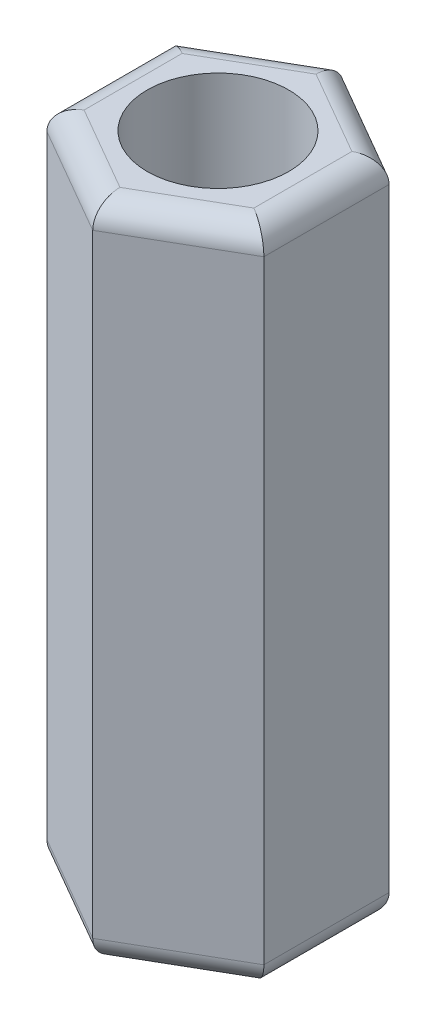
ISO-10303-21;
HEADER;
FILE_DESCRIPTION(('STEP AP214'),'2;1');
FILE_NAME('part.step','',(''),(''),'','','');
FILE_SCHEMA(('AUTOMOTIVE_DESIGN { 1 0 10303 214 1 1 1 1 }'));
ENDSEC;
DATA;
#1=APPLICATION_CONTEXT('core data for automotive mechanical design processes');
#2=APPLICATION_PROTOCOL_DEFINITION('international standard','automotive_design',2000,#1);
#3=PRODUCT_CONTEXT('',#1,'mechanical');
#4=PRODUCT('Part','Part','',(#3));
#5=PRODUCT_RELATED_PRODUCT_CATEGORY('part','',(#4));
#6=PRODUCT_DEFINITION_FORMATION('','',#4);
#7=PRODUCT_DEFINITION_CONTEXT('part definition',#1,'design');
#8=PRODUCT_DEFINITION('design','',#6,#7);
#9=PRODUCT_DEFINITION_SHAPE('','',#8);
#10=(LENGTH_UNIT() NAMED_UNIT(*) SI_UNIT(.MILLI.,.METRE.));
#11=(NAMED_UNIT(*) PLANE_ANGLE_UNIT() SI_UNIT($,.RADIAN.));
#12=(NAMED_UNIT(*) SI_UNIT($,.STERADIAN.) SOLID_ANGLE_UNIT());
#13=UNCERTAINTY_MEASURE_WITH_UNIT(LENGTH_MEASURE(1.E-05),#10,'distance_accuracy_value','');
#14=(GEOMETRIC_REPRESENTATION_CONTEXT(3) GLOBAL_UNCERTAINTY_ASSIGNED_CONTEXT((#13)) GLOBAL_UNIT_ASSIGNED_CONTEXT((#10,
#11,#12)) REPRESENTATION_CONTEXT('',''));
#15=CARTESIAN_POINT('',(0.,0.,0.));
#16=DIRECTION('',(0.,0.,1.));
#17=DIRECTION('',(1.,0.,0.));
#18=AXIS2_PLACEMENT_3D('',#15,#16,#17);
#19=CARTESIAN_POINT('',(0.,14.,0.));
#20=DIRECTION('',(0.,1.,0.));
#21=DIRECTION('',(0.,0.,1.));
#22=AXIS2_PLACEMENT_3D('',#19,#20,#21);
#23=PLANE('',#22);
#24=DIRECTION('',(0.,0.,1.));
#25=VECTOR('',#24,1.);
#26=CARTESIAN_POINT('',(-1.8,14.,1.32790561913614));
#27=LINE('',#26,#25);
#28=CARTESIAN_POINT('',(-1.8,14.,-1.03923048454133));
#29=VERTEX_POINT('',#28);
#30=CARTESIAN_POINT('',(-1.8,14.,1.03923048454133));
#31=VERTEX_POINT('',#30);
#32=EDGE_CURVE('E44',#29,#31,#27,.T.);
#33=ORIENTED_EDGE('',*,*,#32,.T.);
#34=DIRECTION('',(0.866025403784439,0.,0.5));
#35=VECTOR('',#34,1.);
#36=CARTESIAN_POINT('',(0.25,14.,2.22279853638006));
#37=LINE('',#36,#35);
#38=CARTESIAN_POINT('',(0.,14.,2.07846096908265));
#39=VERTEX_POINT('',#38);
#40=EDGE_CURVE('E11',#31,#39,#37,.T.);
#41=ORIENTED_EDGE('',*,*,#40,.T.);
#42=DIRECTION('',(0.866025403784439,0.,-0.5));
#43=VECTOR('',#42,1.);
#44=CARTESIAN_POINT('',(2.05,14.,0.894892917243921));
#45=LINE('',#44,#43);
#46=CARTESIAN_POINT('',(1.8,14.,1.03923048454133));
#47=VERTEX_POINT('',#46);
#48=EDGE_CURVE('E160',#39,#47,#45,.T.);
#49=ORIENTED_EDGE('',*,*,#48,.T.);
#50=DIRECTION('',(0.,0.,-1.));
#51=VECTOR('',#50,1.);
#52=CARTESIAN_POINT('',(1.8,14.,-1.32790561913614));
#53=LINE('',#52,#51);
#54=CARTESIAN_POINT('',(1.8,14.,-1.03923048454133));
#55=VERTEX_POINT('',#54);
#56=EDGE_CURVE('E257',#47,#55,#53,.T.);
#57=ORIENTED_EDGE('',*,*,#56,.T.);
#58=DIRECTION('',(-0.866025403784439,0.,-0.5));
#59=VECTOR('',#58,1.);
#60=CARTESIAN_POINT('',(-0.25,14.,-2.22279853638006));
#61=LINE('',#60,#59);
#62=CARTESIAN_POINT('',(0.,14.,-2.07846096908265));
#63=VERTEX_POINT('',#62);
#64=EDGE_CURVE('E259',#55,#63,#61,.T.);
#65=ORIENTED_EDGE('',*,*,#64,.T.);
#66=DIRECTION('',(-0.866025403784439,0.,0.5));
#67=VECTOR('',#66,1.);
#68=CARTESIAN_POINT('',(-2.05,14.,-0.894892917243921));
#69=LINE('',#68,#67);
#70=EDGE_CURVE('E55',#63,#29,#69,.T.);
#71=ORIENTED_EDGE('',*,*,#70,.T.);
#72=EDGE_LOOP('',(#33,#41,#49,#57,#65,#71));
#73=FACE_BOUND('',#72,.T.);
#74=CARTESIAN_POINT('',(0.,14.,0.));
#75=DIRECTION('',(0.,1.,0.));
#76=DIRECTION('',(0.,0.,1.));
#77=AXIS2_PLACEMENT_3D('',#74,#75,#76);
#78=CIRCLE('',#77,1.5);
#79=CARTESIAN_POINT('',(0.,14.,1.5));
#80=VERTEX_POINT('',#79);
#81=EDGE_CURVE('E149',#80,#80,#78,.T.);
#82=ORIENTED_EDGE('',*,*,#81,.F.);
#83=EDGE_LOOP('',(#82));
#84=FACE_BOUND('',#83,.T.);
#85=ADVANCED_FACE('F35',(#73,#84),#23,.T.);
#86=CARTESIAN_POINT('',(0.,0.,0.));
#87=DIRECTION('',(0.,1.,0.));
#88=DIRECTION('',(0.,0.,1.));
#89=AXIS2_PLACEMENT_3D('',#86,#87,#88);
#90=PLANE('',#89);
#91=DIRECTION('',(0.866025403784439,0.,-0.5));
#92=VECTOR('',#91,1.);
#93=CARTESIAN_POINT('',(0.9,0.,1.55884572681199));
#94=LINE('',#93,#92);
#95=CARTESIAN_POINT('',(1.8,0.,1.03923048454133));
#96=VERTEX_POINT('',#95);
#97=CARTESIAN_POINT('',(0.,0.,2.07846096908265));
#98=VERTEX_POINT('',#97);
#99=EDGE_CURVE('E235',#96,#98,#94,.F.);
#100=ORIENTED_EDGE('',*,*,#99,.T.);
#101=DIRECTION('',(0.866025403784439,0.,0.5));
#102=VECTOR('',#101,1.);
#103=CARTESIAN_POINT('',(-0.9,0.,1.55884572681199));
#104=LINE('',#103,#102);
#105=CARTESIAN_POINT('',(-1.8,0.,1.03923048454133));
#106=VERTEX_POINT('',#105);
#107=EDGE_CURVE('E136',#98,#106,#104,.F.);
#108=ORIENTED_EDGE('',*,*,#107,.T.);
#109=DIRECTION('',(0.,0.,1.));
#110=VECTOR('',#109,1.);
#111=CARTESIAN_POINT('',(-1.8,0.,0.));
#112=LINE('',#111,#110);
#113=CARTESIAN_POINT('',(-1.8,0.,-1.03923048454133));
#114=VERTEX_POINT('',#113);
#115=EDGE_CURVE('E227',#106,#114,#112,.F.);
#116=ORIENTED_EDGE('',*,*,#115,.T.);
#117=DIRECTION('',(-0.866025403784439,0.,0.5));
#118=VECTOR('',#117,1.);
#119=CARTESIAN_POINT('',(-0.9,0.,-1.55884572681199));
#120=LINE('',#119,#118);
#121=CARTESIAN_POINT('',(0.,0.,-2.07846096908265));
#122=VERTEX_POINT('',#121);
#123=EDGE_CURVE('E229',#114,#122,#120,.F.);
#124=ORIENTED_EDGE('',*,*,#123,.T.);
#125=DIRECTION('',(-0.866025403784439,0.,-0.5));
#126=VECTOR('',#125,1.);
#127=CARTESIAN_POINT('',(0.9,0.,-1.55884572681199));
#128=LINE('',#127,#126);
#129=CARTESIAN_POINT('',(1.8,0.,-1.03923048454133));
#130=VERTEX_POINT('',#129);
#131=EDGE_CURVE('E231',#122,#130,#128,.F.);
#132=ORIENTED_EDGE('',*,*,#131,.T.);
#133=DIRECTION('',(0.,0.,-1.));
#134=VECTOR('',#133,1.);
#135=CARTESIAN_POINT('',(1.8,0.,0.));
#136=LINE('',#135,#134);
#137=EDGE_CURVE('E233',#130,#96,#136,.F.);
#138=ORIENTED_EDGE('',*,*,#137,.T.);
#139=EDGE_LOOP('',(#100,#108,#116,#124,#132,#138));
#140=FACE_BOUND('',#139,.T.);
#141=CARTESIAN_POINT('',(0.,0.,0.));
#142=DIRECTION('',(0.,1.,0.));
#143=DIRECTION('',(0.,0.,1.));
#144=AXIS2_PLACEMENT_3D('',#141,#142,#143);
#145=CIRCLE('',#144,1.5);
#146=CARTESIAN_POINT('',(0.,0.,1.5));
#147=VERTEX_POINT('',#146);
#148=EDGE_CURVE('E203',#147,#147,#145,.T.);
#149=ORIENTED_EDGE('',*,*,#148,.T.);
#150=EDGE_LOOP('',(#149));
#151=FACE_BOUND('',#150,.T.);
#152=ADVANCED_FACE('F303',(#140,#151),#90,.F.);
#153=CARTESIAN_POINT('',(0.,14.,2.65581123827228));
#154=DIRECTION('',(-0.5,0.,-0.866025403784439));
#155=DIRECTION('',(-0.866025403784439,0.,0.5));
#156=AXIS2_PLACEMENT_3D('',#153,#154,#155);
#157=PLANE('',#156);
#158=DIRECTION('',(0.,-1.,0.));
#159=VECTOR('',#158,1.);
#160=CARTESIAN_POINT('',(0.,14.,2.65581123827228));
#161=LINE('',#160,#159);
#162=CARTESIAN_POINT('',(0.,13.5,2.65581123827228));
#163=VERTEX_POINT('',#162);
#164=CARTESIAN_POINT('',(0.,0.5,2.65581123827228));
#165=VERTEX_POINT('',#164);
#166=EDGE_CURVE('E128',#163,#165,#161,.T.);
#167=ORIENTED_EDGE('',*,*,#166,.T.);
#168=DIRECTION('',(0.866025403784439,0.,-0.5));
#169=VECTOR('',#168,1.);
#170=CARTESIAN_POINT('',(0.,0.5,2.65581123827228));
#171=LINE('',#170,#169);
#172=CARTESIAN_POINT('',(2.3,0.5,1.32790561913614));
#173=VERTEX_POINT('',#172);
#174=EDGE_CURVE('E135',#165,#173,#171,.T.);
#175=ORIENTED_EDGE('',*,*,#174,.T.);
#176=DIRECTION('',(0.,-1.,0.));
#177=VECTOR('',#176,1.);
#178=CARTESIAN_POINT('',(2.3,14.,1.32790561913614));
#179=LINE('',#178,#177);
#180=CARTESIAN_POINT('',(2.3,13.5,1.32790561913614));
#181=VERTEX_POINT('',#180);
#182=EDGE_CURVE('E130',#181,#173,#179,.T.);
#183=ORIENTED_EDGE('',*,*,#182,.F.);
#184=DIRECTION('',(0.866025403784439,0.,-0.5));
#185=VECTOR('',#184,1.);
#186=CARTESIAN_POINT('',(0.,13.5,2.65581123827228));
#187=LINE('',#186,#185);
#188=EDGE_CURVE('E125',#181,#163,#187,.F.);
#189=ORIENTED_EDGE('',*,*,#188,.T.);
#190=EDGE_LOOP('',(#167,#175,#183,#189));
#191=FACE_BOUND('',#190,.T.);
#192=ADVANCED_FACE('F127',(#191),#157,.F.);
#193=CARTESIAN_POINT('',(2.3,14.,1.32790561913614));
#194=DIRECTION('',(-1.,0.,0.));
#195=DIRECTION('',(0.,0.,1.));
#196=AXIS2_PLACEMENT_3D('',#193,#194,#195);
#197=PLANE('',#196);
#198=ORIENTED_EDGE('',*,*,#182,.T.);
#199=DIRECTION('',(0.,0.,-1.));
#200=VECTOR('',#199,1.);
#201=CARTESIAN_POINT('',(2.3,0.5,1.32790561913614));
#202=LINE('',#201,#200);
#203=CARTESIAN_POINT('',(2.3,0.5,-1.32790561913614));
#204=VERTEX_POINT('',#203);
#205=EDGE_CURVE('E242',#173,#204,#202,.T.);
#206=ORIENTED_EDGE('',*,*,#205,.T.);
#207=DIRECTION('',(0.,-1.,0.));
#208=VECTOR('',#207,1.);
#209=CARTESIAN_POINT('',(2.3,14.,-1.32790561913614));
#210=LINE('',#209,#208);
#211=CARTESIAN_POINT('',(2.3,13.5,-1.32790561913614));
#212=VERTEX_POINT('',#211);
#213=EDGE_CURVE('E222',#212,#204,#210,.T.);
#214=ORIENTED_EDGE('',*,*,#213,.F.);
#215=DIRECTION('',(0.,0.,-1.));
#216=VECTOR('',#215,1.);
#217=CARTESIAN_POINT('',(2.3,13.5,1.32790561913614));
#218=LINE('',#217,#216);
#219=EDGE_CURVE('E240',#212,#181,#218,.F.);
#220=ORIENTED_EDGE('',*,*,#219,.T.);
#221=EDGE_LOOP('',(#198,#206,#214,#220));
#222=FACE_BOUND('',#221,.T.);
#223=ADVANCED_FACE('F271',(#222),#197,.F.);
#224=CARTESIAN_POINT('',(2.3,14.,-1.32790561913614));
#225=DIRECTION('',(-0.5,0.,0.866025403784439));
#226=DIRECTION('',(0.866025403784439,0.,0.5));
#227=AXIS2_PLACEMENT_3D('',#224,#225,#226);
#228=PLANE('',#227);
#229=ORIENTED_EDGE('',*,*,#213,.T.);
#230=DIRECTION('',(-0.866025403784439,0.,-0.5));
#231=VECTOR('',#230,1.);
#232=CARTESIAN_POINT('',(2.3,0.5,-1.32790561913614));
#233=LINE('',#232,#231);
#234=CARTESIAN_POINT('',(0.,0.5,-2.65581123827228));
#235=VERTEX_POINT('',#234);
#236=EDGE_CURVE('E246',#204,#235,#233,.T.);
#237=ORIENTED_EDGE('',*,*,#236,.T.);
#238=DIRECTION('',(0.,-1.,0.));
#239=VECTOR('',#238,1.);
#240=CARTESIAN_POINT('',(0.,14.,-2.65581123827228));
#241=LINE('',#240,#239);
#242=CARTESIAN_POINT('',(0.,13.5,-2.65581123827228));
#243=VERTEX_POINT('',#242);
#244=EDGE_CURVE('E219',#243,#235,#241,.T.);
#245=ORIENTED_EDGE('',*,*,#244,.F.);
#246=DIRECTION('',(-0.866025403784439,0.,-0.5));
#247=VECTOR('',#246,1.);
#248=CARTESIAN_POINT('',(2.3,13.5,-1.32790561913614));
#249=LINE('',#248,#247);
#250=EDGE_CURVE('E244',#243,#212,#249,.F.);
#251=ORIENTED_EDGE('',*,*,#250,.T.);
#252=EDGE_LOOP('',(#229,#237,#245,#251));
#253=FACE_BOUND('',#252,.T.);
#254=ADVANCED_FACE('F274',(#253),#228,.F.);
#255=CARTESIAN_POINT('',(0.,14.,-2.65581123827228));
#256=DIRECTION('',(0.5,0.,0.866025403784439));
#257=DIRECTION('',(0.866025403784439,0.,-0.5));
#258=AXIS2_PLACEMENT_3D('',#255,#256,#257);
#259=PLANE('',#258);
#260=ORIENTED_EDGE('',*,*,#244,.T.);
#261=DIRECTION('',(-0.866025403784439,0.,0.5));
#262=VECTOR('',#261,1.);
#263=CARTESIAN_POINT('',(0.,0.5,-2.65581123827228));
#264=LINE('',#263,#262);
#265=CARTESIAN_POINT('',(-2.3,0.5,-1.32790561913614));
#266=VERTEX_POINT('',#265);
#267=EDGE_CURVE('E250',#235,#266,#264,.T.);
#268=ORIENTED_EDGE('',*,*,#267,.T.);
#269=DIRECTION('',(0.,-1.,0.));
#270=VECTOR('',#269,1.);
#271=CARTESIAN_POINT('',(-2.3,14.,-1.32790561913614));
#272=LINE('',#271,#270);
#273=CARTESIAN_POINT('',(-2.3,13.5,-1.32790561913614));
#274=VERTEX_POINT('',#273);
#275=EDGE_CURVE('E216',#274,#266,#272,.T.);
#276=ORIENTED_EDGE('',*,*,#275,.F.);
#277=DIRECTION('',(-0.866025403784439,0.,0.5));
#278=VECTOR('',#277,1.);
#279=CARTESIAN_POINT('',(0.,13.5,-2.65581123827228));
#280=LINE('',#279,#278);
#281=EDGE_CURVE('E248',#274,#243,#280,.F.);
#282=ORIENTED_EDGE('',*,*,#281,.T.);
#283=EDGE_LOOP('',(#260,#268,#276,#282));
#284=FACE_BOUND('',#283,.T.);
#285=ADVANCED_FACE('F284',(#284),#259,.F.);
#286=CARTESIAN_POINT('',(-2.3,14.,-1.32790561913614));
#287=DIRECTION('',(1.,0.,0.));
#288=DIRECTION('',(0.,0.,-1.));
#289=AXIS2_PLACEMENT_3D('',#286,#287,#288);
#290=PLANE('',#289);
#291=ORIENTED_EDGE('',*,*,#275,.T.);
#292=DIRECTION('',(0.,0.,1.));
#293=VECTOR('',#292,1.);
#294=CARTESIAN_POINT('',(-2.3,0.5,-1.32790561913614));
#295=LINE('',#294,#293);
#296=CARTESIAN_POINT('',(-2.3,0.5,1.32790561913614));
#297=VERTEX_POINT('',#296);
#298=EDGE_CURVE('E254',#266,#297,#295,.T.);
#299=ORIENTED_EDGE('',*,*,#298,.T.);
#300=DIRECTION('',(0.,-1.,0.));
#301=VECTOR('',#300,1.);
#302=CARTESIAN_POINT('',(-2.3,14.,1.32790561913614));
#303=LINE('',#302,#301);
#304=CARTESIAN_POINT('',(-2.3,13.5,1.32790561913614));
#305=VERTEX_POINT('',#304);
#306=EDGE_CURVE('E148',#305,#297,#303,.T.);
#307=ORIENTED_EDGE('',*,*,#306,.F.);
#308=DIRECTION('',(0.,0.,1.));
#309=VECTOR('',#308,1.);
#310=CARTESIAN_POINT('',(-2.3,13.5,-1.32790561913614));
#311=LINE('',#310,#309);
#312=EDGE_CURVE('E252',#305,#274,#311,.F.);
#313=ORIENTED_EDGE('',*,*,#312,.T.);
#314=EDGE_LOOP('',(#291,#299,#307,#313));
#315=FACE_BOUND('',#314,.T.);
#316=ADVANCED_FACE('F286',(#315),#290,.F.);
#317=CARTESIAN_POINT('',(-2.3,14.,1.32790561913614));
#318=DIRECTION('',(0.5,0.,-0.866025403784438));
#319=DIRECTION('',(-0.866025403784439,0.,-0.5));
#320=AXIS2_PLACEMENT_3D('',#317,#318,#319);
#321=PLANE('',#320);
#322=ORIENTED_EDGE('',*,*,#306,.T.);
#323=DIRECTION('',(0.866025403784439,0.,0.5));
#324=VECTOR('',#323,1.);
#325=CARTESIAN_POINT('',(-2.3,0.5,1.32790561913614));
#326=LINE('',#325,#324);
#327=EDGE_CURVE('E147',#297,#165,#326,.T.);
#328=ORIENTED_EDGE('',*,*,#327,.T.);
#329=ORIENTED_EDGE('',*,*,#166,.F.);
#330=DIRECTION('',(0.866025403784439,0.,0.5));
#331=VECTOR('',#330,1.);
#332=CARTESIAN_POINT('',(-2.3,13.5,1.32790561913614));
#333=LINE('',#332,#331);
#334=EDGE_CURVE('E144',#163,#305,#333,.F.);
#335=ORIENTED_EDGE('',*,*,#334,.T.);
#336=EDGE_LOOP('',(#322,#328,#329,#335));
#337=FACE_BOUND('',#336,.T.);
#338=ADVANCED_FACE('F143',(#337),#321,.F.);
#339=CARTESIAN_POINT('',(0.,14.,0.));
#340=DIRECTION('',(0.,-1.,0.));
#341=DIRECTION('',(0.,0.,-1.));
#342=AXIS2_PLACEMENT_3D('',#339,#340,#341);
#343=CYLINDRICAL_SURFACE('',#342,1.5);
#344=ORIENTED_EDGE('',*,*,#81,.T.);
#345=EDGE_LOOP('',(#344));
#346=FACE_BOUND('',#345,.T.);
#347=ORIENTED_EDGE('',*,*,#148,.F.);
#348=EDGE_LOOP('',(#347));
#349=FACE_BOUND('',#348,.T.);
#350=ADVANCED_FACE('F311',(#346,#349),#343,.F.);
#351=CARTESIAN_POINT('',(2.05,0.5,-0.894892917243921));
#352=DIRECTION('',(-0.866025403784439,0.,-0.5));
#353=DIRECTION('',(-0.5,0.,0.866025403784439));
#354=AXIS2_PLACEMENT_3D('',#351,#352,#353);
#355=CYLINDRICAL_SURFACE('',#354,0.5);
#356=CARTESIAN_POINT('',(1.8,0.5,-1.03923048454133));
#357=DIRECTION('',(-0.5,0.,-0.866025403784439));
#358=DIRECTION('',(-0.866025403784439,0.,0.5));
#359=AXIS2_PLACEMENT_3D('',#356,#357,#358);
#360=ELLIPSE('',#359,0.577350269189626,0.5);
#361=EDGE_CURVE('E196',#130,#204,#360,.F.);
#362=ORIENTED_EDGE('',*,*,#361,.F.);
#363=ORIENTED_EDGE('',*,*,#131,.F.);
#364=CARTESIAN_POINT('',(0.,0.5,-2.07846096908265));
#365=DIRECTION('',(-1.,0.,0.));
#366=DIRECTION('',(0.,0.,1.));
#367=AXIS2_PLACEMENT_3D('',#364,#365,#366);
#368=ELLIPSE('',#367,0.577350269189626,0.5);
#369=EDGE_CURVE('E165',#235,#122,#368,.T.);
#370=ORIENTED_EDGE('',*,*,#369,.F.);
#371=ORIENTED_EDGE('',*,*,#236,.F.);
#372=EDGE_LOOP('',(#362,#363,#370,#371));
#373=FACE_BOUND('',#372,.T.);
#374=ADVANCED_FACE('F277',(#373),#355,.T.);
#375=CARTESIAN_POINT('',(0.25,0.5,-2.22279853638006));
#376=DIRECTION('',(-0.866025403784439,0.,0.5));
#377=DIRECTION('',(0.5,0.,0.866025403784439));
#378=AXIS2_PLACEMENT_3D('',#375,#376,#377);
#379=CYLINDRICAL_SURFACE('',#378,0.5);
#380=ORIENTED_EDGE('',*,*,#369,.T.);
#381=ORIENTED_EDGE('',*,*,#123,.F.);
#382=CARTESIAN_POINT('',(-1.8,0.5,-1.03923048454133));
#383=DIRECTION('',(-0.5,0.,0.866025403784439));
#384=DIRECTION('',(0.866025403784439,0.,0.5));
#385=AXIS2_PLACEMENT_3D('',#382,#383,#384);
#386=ELLIPSE('',#385,0.577350269189626,0.5);
#387=EDGE_CURVE('E194',#266,#114,#386,.T.);
#388=ORIENTED_EDGE('',*,*,#387,.F.);
#389=ORIENTED_EDGE('',*,*,#267,.F.);
#390=EDGE_LOOP('',(#380,#381,#388,#389));
#391=FACE_BOUND('',#390,.T.);
#392=ADVANCED_FACE('F280',(#391),#379,.T.);
#393=CARTESIAN_POINT('',(1.8,0.5,1.32790561913614));
#394=DIRECTION('',(0.,0.,-1.));
#395=DIRECTION('',(-1.,0.,0.));
#396=AXIS2_PLACEMENT_3D('',#393,#394,#395);
#397=CYLINDRICAL_SURFACE('',#396,0.5);
#398=ORIENTED_EDGE('',*,*,#361,.T.);
#399=ORIENTED_EDGE('',*,*,#205,.F.);
#400=CARTESIAN_POINT('',(1.8,0.5,1.03923048454133));
#401=DIRECTION('',(0.5,0.,-0.866025403784439));
#402=DIRECTION('',(-0.866025403784439,0.,-0.5));
#403=AXIS2_PLACEMENT_3D('',#400,#401,#402);
#404=ELLIPSE('',#403,0.577350269189626,0.5);
#405=EDGE_CURVE('E188',#96,#173,#404,.F.);
#406=ORIENTED_EDGE('',*,*,#405,.F.);
#407=ORIENTED_EDGE('',*,*,#137,.F.);
#408=EDGE_LOOP('',(#398,#399,#406,#407));
#409=FACE_BOUND('',#408,.T.);
#410=ADVANCED_FACE('F365',(#409),#397,.T.);
#411=CARTESIAN_POINT('',(-1.8,0.5,-1.32790561913614));
#412=DIRECTION('',(0.,0.,1.));
#413=DIRECTION('',(1.,0.,0.));
#414=AXIS2_PLACEMENT_3D('',#411,#412,#413);
#415=CYLINDRICAL_SURFACE('',#414,0.5);
#416=ORIENTED_EDGE('',*,*,#387,.T.);
#417=ORIENTED_EDGE('',*,*,#115,.F.);
#418=CARTESIAN_POINT('',(-1.8,0.5,1.03923048454133));
#419=DIRECTION('',(0.5,0.,0.866025403784439));
#420=DIRECTION('',(-0.866025403784439,0.,0.5));
#421=AXIS2_PLACEMENT_3D('',#418,#419,#420);
#422=ELLIPSE('',#421,0.577350269189626,0.5);
#423=EDGE_CURVE('E182',#297,#106,#422,.T.);
#424=ORIENTED_EDGE('',*,*,#423,.F.);
#425=ORIENTED_EDGE('',*,*,#298,.F.);
#426=EDGE_LOOP('',(#416,#417,#424,#425));
#427=FACE_BOUND('',#426,.T.);
#428=ADVANCED_FACE('F290',(#427),#415,.T.);
#429=CARTESIAN_POINT('',(-0.250000000000001,0.5,2.22279853638006));
#430=DIRECTION('',(0.866025403784439,0.,-0.5));
#431=DIRECTION('',(-0.5,0.,-0.866025403784439));
#432=AXIS2_PLACEMENT_3D('',#429,#430,#431);
#433=CYLINDRICAL_SURFACE('',#432,0.5);
#434=ORIENTED_EDGE('',*,*,#405,.T.);
#435=ORIENTED_EDGE('',*,*,#174,.F.);
#436=CARTESIAN_POINT('',(0.,0.5,2.07846096908265));
#437=DIRECTION('',(1.,0.,0.));
#438=DIRECTION('',(0.,0.,-1.));
#439=AXIS2_PLACEMENT_3D('',#436,#437,#438);
#440=ELLIPSE('',#439,0.577350269189626,0.5);
#441=EDGE_CURVE('E178',#98,#165,#440,.F.);
#442=ORIENTED_EDGE('',*,*,#441,.F.);
#443=ORIENTED_EDGE('',*,*,#99,.F.);
#444=EDGE_LOOP('',(#434,#435,#442,#443));
#445=FACE_BOUND('',#444,.T.);
#446=ADVANCED_FACE('F293',(#445),#433,.T.);
#447=CARTESIAN_POINT('',(-2.05,0.5,0.89489291724392));
#448=DIRECTION('',(0.866025403784439,0.,0.5));
#449=DIRECTION('',(0.5,0.,-0.866025403784438));
#450=AXIS2_PLACEMENT_3D('',#447,#448,#449);
#451=CYLINDRICAL_SURFACE('',#450,0.5);
#452=ORIENTED_EDGE('',*,*,#423,.T.);
#453=ORIENTED_EDGE('',*,*,#107,.F.);
#454=ORIENTED_EDGE('',*,*,#441,.T.);
#455=ORIENTED_EDGE('',*,*,#327,.F.);
#456=EDGE_LOOP('',(#452,#453,#454,#455));
#457=FACE_BOUND('',#456,.T.);
#458=ADVANCED_FACE('F291',(#457),#451,.T.);
#459=CARTESIAN_POINT('',(0.9,13.5,-1.55884572681199));
#460=DIRECTION('',(0.866025403784439,0.,0.5));
#461=DIRECTION('',(0.5,0.,-0.866025403784439));
#462=AXIS2_PLACEMENT_3D('',#459,#460,#461);
#463=CYLINDRICAL_SURFACE('',#462,0.5);
#464=CARTESIAN_POINT('',(1.8,13.5,-1.03923048454133));
#465=DIRECTION('',(0.5,0.,0.866025403784439));
#466=DIRECTION('',(-0.866025403784439,0.,0.5));
#467=AXIS2_PLACEMENT_3D('',#464,#465,#466);
#468=ELLIPSE('',#467,0.577350269189626,0.5);
#469=EDGE_CURVE('E171',#212,#55,#468,.T.);
#470=ORIENTED_EDGE('',*,*,#469,.F.);
#471=ORIENTED_EDGE('',*,*,#250,.F.);
#472=CARTESIAN_POINT('',(0.,13.5,-2.07846096908265));
#473=DIRECTION('',(1.,0.,0.));
#474=DIRECTION('',(0.,0.,1.));
#475=AXIS2_PLACEMENT_3D('',#472,#473,#474);
#476=ELLIPSE('',#475,0.577350269189626,0.5);
#477=EDGE_CURVE('E39',#63,#243,#476,.F.);
#478=ORIENTED_EDGE('',*,*,#477,.F.);
#479=ORIENTED_EDGE('',*,*,#64,.F.);
#480=EDGE_LOOP('',(#470,#471,#478,#479));
#481=FACE_BOUND('',#480,.T.);
#482=ADVANCED_FACE('F37',(#481),#463,.T.);
#483=CARTESIAN_POINT('',(-0.9,13.5,-1.55884572681199));
#484=DIRECTION('',(0.866025403784439,0.,-0.5));
#485=DIRECTION('',(-0.5,0.,-0.866025403784439));
#486=AXIS2_PLACEMENT_3D('',#483,#484,#485);
#487=CYLINDRICAL_SURFACE('',#486,0.5);
#488=ORIENTED_EDGE('',*,*,#477,.T.);
#489=ORIENTED_EDGE('',*,*,#281,.F.);
#490=CARTESIAN_POINT('',(-1.8,13.5,-1.03923048454133));
#491=DIRECTION('',(0.5,0.,-0.866025403784439));
#492=DIRECTION('',(0.866025403784439,0.,0.5));
#493=AXIS2_PLACEMENT_3D('',#490,#491,#492);
#494=ELLIPSE('',#493,0.577350269189626,0.5);
#495=EDGE_CURVE('E169',#29,#274,#494,.F.);
#496=ORIENTED_EDGE('',*,*,#495,.F.);
#497=ORIENTED_EDGE('',*,*,#70,.F.);
#498=EDGE_LOOP('',(#488,#489,#496,#497));
#499=FACE_BOUND('',#498,.T.);
#500=ADVANCED_FACE('F265',(#499),#487,.T.);
#501=CARTESIAN_POINT('',(1.8,13.5,0.));
#502=DIRECTION('',(0.,0.,1.));
#503=DIRECTION('',(1.,0.,0.));
#504=AXIS2_PLACEMENT_3D('',#501,#502,#503);
#505=CYLINDRICAL_SURFACE('',#504,0.5);
#506=ORIENTED_EDGE('',*,*,#469,.T.);
#507=ORIENTED_EDGE('',*,*,#56,.F.);
#508=CARTESIAN_POINT('',(1.8,13.5,1.03923048454133));
#509=DIRECTION('',(-0.5,0.,0.866025403784439));
#510=DIRECTION('',(-0.866025403784439,0.,-0.5));
#511=AXIS2_PLACEMENT_3D('',#508,#509,#510);
#512=ELLIPSE('',#511,0.577350269189626,0.5);
#513=EDGE_CURVE('E162',#181,#47,#512,.T.);
#514=ORIENTED_EDGE('',*,*,#513,.F.);
#515=ORIENTED_EDGE('',*,*,#219,.F.);
#516=EDGE_LOOP('',(#506,#507,#514,#515));
#517=FACE_BOUND('',#516,.T.);
#518=ADVANCED_FACE('F268',(#517),#505,.T.);
#519=CARTESIAN_POINT('',(-1.8,13.5,0.));
#520=DIRECTION('',(0.,0.,-1.));
#521=DIRECTION('',(-1.,0.,0.));
#522=AXIS2_PLACEMENT_3D('',#519,#520,#521);
#523=CYLINDRICAL_SURFACE('',#522,0.5);
#524=ORIENTED_EDGE('',*,*,#495,.T.);
#525=ORIENTED_EDGE('',*,*,#312,.F.);
#526=CARTESIAN_POINT('',(-1.8,13.5,1.03923048454133));
#527=DIRECTION('',(-0.5,0.,-0.866025403784439));
#528=DIRECTION('',(0.866025403784439,0.,-0.5));
#529=AXIS2_PLACEMENT_3D('',#526,#527,#528);
#530=ELLIPSE('',#529,0.577350269189626,0.5);
#531=EDGE_CURVE('E156',#31,#305,#530,.F.);
#532=ORIENTED_EDGE('',*,*,#531,.F.);
#533=ORIENTED_EDGE('',*,*,#32,.F.);
#534=EDGE_LOOP('',(#524,#525,#532,#533));
#535=FACE_BOUND('',#534,.T.);
#536=ADVANCED_FACE('F267',(#535),#523,.T.);
#537=CARTESIAN_POINT('',(0.9,13.5,1.55884572681199));
#538=DIRECTION('',(-0.866025403784439,0.,0.5));
#539=DIRECTION('',(0.5,0.,0.866025403784439));
#540=AXIS2_PLACEMENT_3D('',#537,#538,#539);
#541=CYLINDRICAL_SURFACE('',#540,0.5);
#542=ORIENTED_EDGE('',*,*,#513,.T.);
#543=ORIENTED_EDGE('',*,*,#48,.F.);
#544=CARTESIAN_POINT('',(0.,13.5,2.07846096908265));
#545=DIRECTION('',(-1.,0.,0.));
#546=DIRECTION('',(0.,0.,1.));
#547=AXIS2_PLACEMENT_3D('',#544,#545,#546);
#548=ELLIPSE('',#547,0.577350269189626,0.5);
#549=EDGE_CURVE('E154',#163,#39,#548,.T.);
#550=ORIENTED_EDGE('',*,*,#549,.F.);
#551=ORIENTED_EDGE('',*,*,#188,.F.);
#552=EDGE_LOOP('',(#542,#543,#550,#551));
#553=FACE_BOUND('',#552,.T.);
#554=ADVANCED_FACE('F159',(#553),#541,.T.);
#555=CARTESIAN_POINT('',(-0.900000000000001,13.5,1.55884572681199));
#556=DIRECTION('',(-0.866025403784439,0.,-0.5));
#557=DIRECTION('',(-0.5,0.,0.866025403784438));
#558=AXIS2_PLACEMENT_3D('',#555,#556,#557);
#559=CYLINDRICAL_SURFACE('',#558,0.5);
#560=ORIENTED_EDGE('',*,*,#531,.T.);
#561=ORIENTED_EDGE('',*,*,#334,.F.);
#562=ORIENTED_EDGE('',*,*,#549,.T.);
#563=ORIENTED_EDGE('',*,*,#40,.F.);
#564=EDGE_LOOP('',(#560,#561,#562,#563));
#565=FACE_BOUND('',#564,.T.);
#566=ADVANCED_FACE('F152',(#565),#559,.T.);
#567=CLOSED_SHELL('',(#85,#152,#192,#223,#254,#285,#316,#338,#350,#374,#392,#410,#428,#446,#458,
#482,#500,#518,#536,#554,#566));
#568=MANIFOLD_SOLID_BREP('B2',#567);
#569=ADVANCED_BREP_SHAPE_REPRESENTATION('',(#18,#568),#14);
#570=SHAPE_DEFINITION_REPRESENTATION(#9,#569);
ENDSEC;
END-ISO-10303-21;
